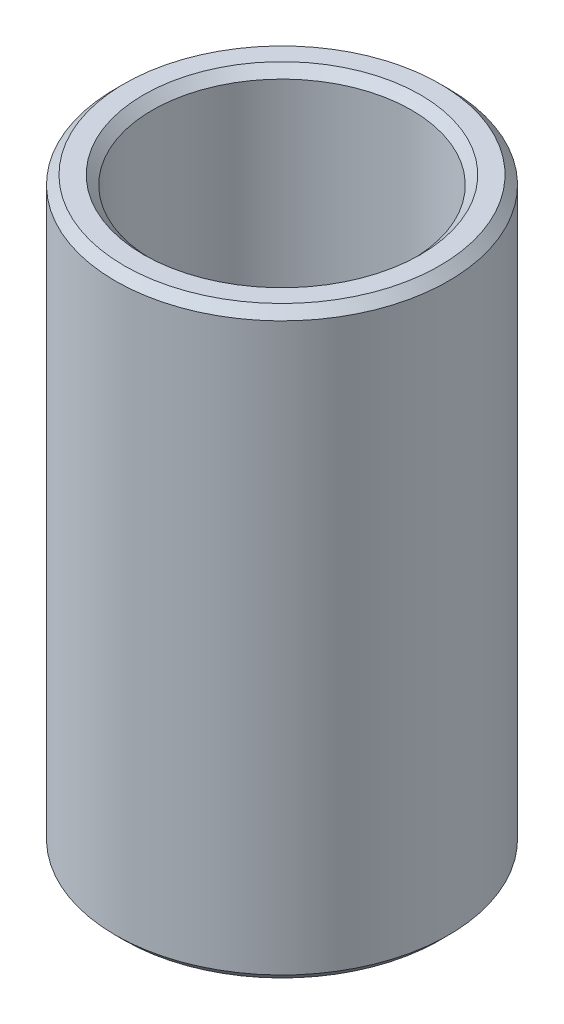
ISO-10303-21;
HEADER;
FILE_DESCRIPTION(('STEP AP214'),'2;1');
FILE_NAME('part.step','',(''),(''),'','','');
FILE_SCHEMA(('AUTOMOTIVE_DESIGN { 1 0 10303 214 1 1 1 1 }'));
ENDSEC;
DATA;
#1=APPLICATION_CONTEXT('core data for automotive mechanical design processes');
#2=APPLICATION_PROTOCOL_DEFINITION('international standard','automotive_design',2000,#1);
#3=PRODUCT_CONTEXT('',#1,'mechanical');
#4=PRODUCT('Part','Part','',(#3));
#5=PRODUCT_RELATED_PRODUCT_CATEGORY('part','',(#4));
#6=PRODUCT_DEFINITION_FORMATION('','',#4);
#7=PRODUCT_DEFINITION_CONTEXT('part definition',#1,'design');
#8=PRODUCT_DEFINITION('design','',#6,#7);
#9=PRODUCT_DEFINITION_SHAPE('','',#8);
#10=(LENGTH_UNIT() NAMED_UNIT(*) SI_UNIT(.MILLI.,.METRE.));
#11=(NAMED_UNIT(*) PLANE_ANGLE_UNIT() SI_UNIT($,.RADIAN.));
#12=(NAMED_UNIT(*) SI_UNIT($,.STERADIAN.) SOLID_ANGLE_UNIT());
#13=UNCERTAINTY_MEASURE_WITH_UNIT(LENGTH_MEASURE(1.E-05),#10,'distance_accuracy_value','');
#14=(GEOMETRIC_REPRESENTATION_CONTEXT(3) GLOBAL_UNCERTAINTY_ASSIGNED_CONTEXT((#13)) GLOBAL_UNIT_ASSIGNED_CONTEXT((#10,
#11,#12)) REPRESENTATION_CONTEXT('',''));
#15=CARTESIAN_POINT('',(0.,0.,0.));
#16=DIRECTION('',(0.,0.,1.));
#17=DIRECTION('',(1.,0.,0.));
#18=AXIS2_PLACEMENT_3D('',#15,#16,#17);
#19=CARTESIAN_POINT('',(0.,175.358771010874,0.));
#20=DIRECTION('',(0.,-1.,0.));
#21=DIRECTION('',(0.,0.,-1.));
#22=AXIS2_PLACEMENT_3D('',#19,#20,#21);
#23=CYLINDRICAL_SURFACE('',#22,50.);
#24=CARTESIAN_POINT('',(0.,2.65141601022975,0.));
#25=DIRECTION('',(0.,1.,0.));
#26=DIRECTION('',(0.,0.,1.));
#27=AXIS2_PLACEMENT_3D('',#24,#25,#26);
#28=CIRCLE('',#27,50.);
#29=CARTESIAN_POINT('',(0.,2.65141601022975,50.));
#30=VERTEX_POINT('',#29);
#31=EDGE_CURVE('E10',#30,#30,#28,.T.);
#32=ORIENTED_EDGE('',*,*,#31,.T.);
#33=EDGE_LOOP('',(#32));
#34=FACE_BOUND('',#33,.T.);
#35=CARTESIAN_POINT('',(0.,172.707355000644,0.));
#36=DIRECTION('',(0.,1.,0.));
#37=DIRECTION('',(0.,0.,1.));
#38=AXIS2_PLACEMENT_3D('',#35,#36,#37);
#39=CIRCLE('',#38,50.);
#40=CARTESIAN_POINT('',(0.,172.707355000644,50.));
#41=VERTEX_POINT('',#40);
#42=EDGE_CURVE('E50',#41,#41,#39,.F.);
#43=ORIENTED_EDGE('',*,*,#42,.T.);
#44=EDGE_LOOP('',(#43));
#45=FACE_BOUND('',#44,.T.);
#46=ADVANCED_FACE('F39',(#34,#45),#23,.T.);
#47=CARTESIAN_POINT('',(0.,175.358771010874,0.));
#48=DIRECTION('',(0.,1.,0.));
#49=DIRECTION('',(0.,0.,1.));
#50=AXIS2_PLACEMENT_3D('',#47,#48,#49);
#51=PLANE('',#50);
#52=CARTESIAN_POINT('',(0.,175.358771010874,0.));
#53=DIRECTION('',(0.,1.,0.));
#54=DIRECTION('',(0.,0.,1.));
#55=AXIS2_PLACEMENT_3D('',#52,#53,#54);
#56=CIRCLE('',#55,41.5622122676888);
#57=CARTESIAN_POINT('',(0.,175.358771010874,41.5622122676888));
#58=VERTEX_POINT('',#57);
#59=EDGE_CURVE('E58',#58,#58,#56,.F.);
#60=ORIENTED_EDGE('',*,*,#59,.T.);
#61=EDGE_LOOP('',(#60));
#62=FACE_BOUND('',#61,.T.);
#63=CARTESIAN_POINT('',(0.,175.358771010874,0.));
#64=DIRECTION('',(0.,1.,0.));
#65=DIRECTION('',(0.,0.,1.));
#66=AXIS2_PLACEMENT_3D('',#63,#64,#65);
#67=CIRCLE('',#66,47.3485839897703);
#68=CARTESIAN_POINT('',(0.,175.358771010874,47.3485839897703));
#69=VERTEX_POINT('',#68);
#70=EDGE_CURVE('E61',#69,#69,#67,.T.);
#71=ORIENTED_EDGE('',*,*,#70,.T.);
#72=EDGE_LOOP('',(#71));
#73=FACE_BOUND('',#72,.T.);
#74=ADVANCED_FACE('F88',(#62,#73),#51,.T.);
#75=CARTESIAN_POINT('',(0.,0.,0.));
#76=DIRECTION('',(0.,1.,0.));
#77=DIRECTION('',(0.,0.,1.));
#78=AXIS2_PLACEMENT_3D('',#75,#76,#77);
#79=PLANE('',#78);
#80=CARTESIAN_POINT('',(0.,0.,0.));
#81=DIRECTION('',(0.,1.,0.));
#82=DIRECTION('',(0.,0.,1.));
#83=AXIS2_PLACEMENT_3D('',#80,#81,#82);
#84=CIRCLE('',#83,41.5622122676888);
#85=CARTESIAN_POINT('',(0.,0.,41.5622122676888));
#86=VERTEX_POINT('',#85);
#87=EDGE_CURVE('E51',#86,#86,#84,.T.);
#88=ORIENTED_EDGE('',*,*,#87,.T.);
#89=EDGE_LOOP('',(#88));
#90=FACE_BOUND('',#89,.T.);
#91=CARTESIAN_POINT('',(0.,0.,0.));
#92=DIRECTION('',(0.,1.,0.));
#93=DIRECTION('',(0.,0.,1.));
#94=AXIS2_PLACEMENT_3D('',#91,#92,#93);
#95=CIRCLE('',#94,47.3485839897702);
#96=CARTESIAN_POINT('',(0.,0.,47.3485839897702));
#97=VERTEX_POINT('',#96);
#98=EDGE_CURVE('E54',#97,#97,#95,.F.);
#99=ORIENTED_EDGE('',*,*,#98,.T.);
#100=EDGE_LOOP('',(#99));
#101=FACE_BOUND('',#100,.T.);
#102=ADVANCED_FACE('F83',(#90,#101),#79,.F.);
#103=CARTESIAN_POINT('',(0.,175.358771010874,0.));
#104=DIRECTION('',(0.,-1.,0.));
#105=DIRECTION('',(0.,0.,-1.));
#106=AXIS2_PLACEMENT_3D('',#103,#104,#105);
#107=CYLINDRICAL_SURFACE('',#106,38.9107962574591);
#108=CARTESIAN_POINT('',(0.,172.707355000644,0.));
#109=DIRECTION('',(0.,1.,0.));
#110=DIRECTION('',(0.,0.,1.));
#111=AXIS2_PLACEMENT_3D('',#108,#109,#110);
#112=CIRCLE('',#111,38.9107962574591);
#113=CARTESIAN_POINT('',(0.,172.707355000644,38.9107962574591));
#114=VERTEX_POINT('',#113);
#115=EDGE_CURVE('E67',#114,#114,#112,.T.);
#116=ORIENTED_EDGE('',*,*,#115,.T.);
#117=EDGE_LOOP('',(#116));
#118=FACE_BOUND('',#117,.T.);
#119=CARTESIAN_POINT('',(0.,2.65141601022975,0.));
#120=DIRECTION('',(0.,1.,0.));
#121=DIRECTION('',(0.,0.,1.));
#122=AXIS2_PLACEMENT_3D('',#119,#120,#121);
#123=CIRCLE('',#122,38.9107962574591);
#124=CARTESIAN_POINT('',(0.,2.65141601022975,38.9107962574591));
#125=VERTEX_POINT('',#124);
#126=EDGE_CURVE('E69',#125,#125,#123,.F.);
#127=ORIENTED_EDGE('',*,*,#126,.T.);
#128=EDGE_LOOP('',(#127));
#129=FACE_BOUND('',#128,.T.);
#130=ADVANCED_FACE('F71',(#118,#129),#107,.F.);
#131=CARTESIAN_POINT('',(0.,172.707355000644,0.));
#132=DIRECTION('',(0.,1.,0.));
#133=DIRECTION('',(0.,0.,1.));
#134=AXIS2_PLACEMENT_3D('',#131,#132,#133);
#135=CONICAL_SURFACE('',#134,38.9107962574591,0.785398163397451);
#136=ORIENTED_EDGE('',*,*,#59,.F.);
#137=EDGE_LOOP('',(#136));
#138=FACE_BOUND('',#137,.T.);
#139=ORIENTED_EDGE('',*,*,#115,.F.);
#140=EDGE_LOOP('',(#139));
#141=FACE_BOUND('',#140,.T.);
#142=ADVANCED_FACE('F77',(#138,#141),#135,.F.);
#143=CARTESIAN_POINT('',(0.,0.,0.));
#144=DIRECTION('',(0.,-1.,0.));
#145=DIRECTION('',(0.,0.,-1.));
#146=AXIS2_PLACEMENT_3D('',#143,#144,#145);
#147=CONICAL_SURFACE('',#146,41.5622122676888,0.785398163397451);
#148=ORIENTED_EDGE('',*,*,#126,.F.);
#149=EDGE_LOOP('',(#148));
#150=FACE_BOUND('',#149,.T.);
#151=ORIENTED_EDGE('',*,*,#87,.F.);
#152=EDGE_LOOP('',(#151));
#153=FACE_BOUND('',#152,.T.);
#154=ADVANCED_FACE('F73',(#150,#153),#147,.F.);
#155=CARTESIAN_POINT('',(0.,2.65141601022975,0.));
#156=DIRECTION('',(0.,1.,0.));
#157=DIRECTION('',(0.,0.,1.));
#158=AXIS2_PLACEMENT_3D('',#155,#156,#157);
#159=CONICAL_SURFACE('',#158,50.,0.78539816339745);
#160=ORIENTED_EDGE('',*,*,#98,.F.);
#161=EDGE_LOOP('',(#160));
#162=FACE_BOUND('',#161,.T.);
#163=ORIENTED_EDGE('',*,*,#31,.F.);
#164=EDGE_LOOP('',(#163));
#165=FACE_BOUND('',#164,.T.);
#166=ADVANCED_FACE('F76',(#162,#165),#159,.T.);
#167=CARTESIAN_POINT('',(0.,175.358771010874,0.));
#168=DIRECTION('',(0.,-1.,0.));
#169=DIRECTION('',(0.,0.,-1.));
#170=AXIS2_PLACEMENT_3D('',#167,#168,#169);
#171=CONICAL_SURFACE('',#170,47.3485839897703,0.785398163397447);
#172=ORIENTED_EDGE('',*,*,#42,.F.);
#173=EDGE_LOOP('',(#172));
#174=FACE_BOUND('',#173,.T.);
#175=ORIENTED_EDGE('',*,*,#70,.F.);
#176=EDGE_LOOP('',(#175));
#177=FACE_BOUND('',#176,.T.);
#178=ADVANCED_FACE('F45',(#174,#177),#171,.T.);
#179=CLOSED_SHELL('',(#46,#74,#102,#130,#142,#154,#166,#178));
#180=MANIFOLD_SOLID_BREP('B2',#179);
#181=ADVANCED_BREP_SHAPE_REPRESENTATION('',(#18,#180),#14);
#182=SHAPE_DEFINITION_REPRESENTATION(#9,#181);
ENDSEC;
END-ISO-10303-21;
